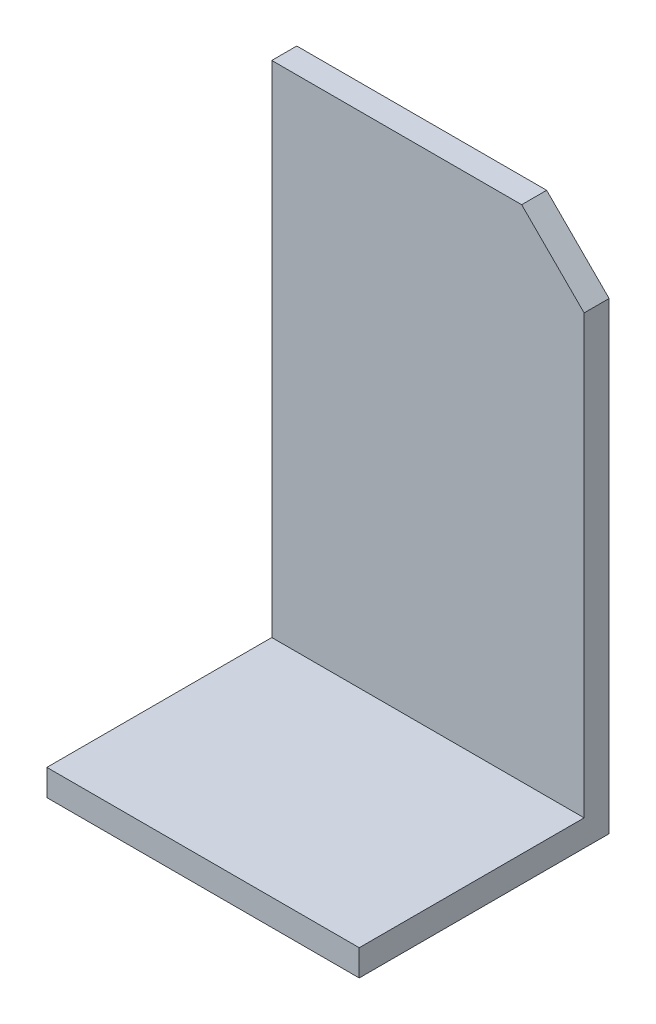
ISO-10303-21;
HEADER;
FILE_DESCRIPTION(('STEP AP214'),'2;1');
FILE_NAME('part.step','',(''),(''),'','','');
FILE_SCHEMA(('AUTOMOTIVE_DESIGN { 1 0 10303 214 1 1 1 1 }'));
ENDSEC;
DATA;
#1=APPLICATION_CONTEXT('core data for automotive mechanical design processes');
#2=APPLICATION_PROTOCOL_DEFINITION('international standard','automotive_design',2000,#1);
#3=PRODUCT_CONTEXT('',#1,'mechanical');
#4=PRODUCT('Part','Part','',(#3));
#5=PRODUCT_RELATED_PRODUCT_CATEGORY('part','',(#4));
#6=PRODUCT_DEFINITION_FORMATION('','',#4);
#7=PRODUCT_DEFINITION_CONTEXT('part definition',#1,'design');
#8=PRODUCT_DEFINITION('design','',#6,#7);
#9=PRODUCT_DEFINITION_SHAPE('','',#8);
#10=(LENGTH_UNIT() NAMED_UNIT(*) SI_UNIT(.MILLI.,.METRE.));
#11=(NAMED_UNIT(*) PLANE_ANGLE_UNIT() SI_UNIT($,.RADIAN.));
#12=(NAMED_UNIT(*) SI_UNIT($,.STERADIAN.) SOLID_ANGLE_UNIT());
#13=UNCERTAINTY_MEASURE_WITH_UNIT(LENGTH_MEASURE(1.E-05),#10,'distance_accuracy_value','');
#14=(GEOMETRIC_REPRESENTATION_CONTEXT(3) GLOBAL_UNCERTAINTY_ASSIGNED_CONTEXT((#13)) GLOBAL_UNIT_ASSIGNED_CONTEXT((#10,
#11,#12)) REPRESENTATION_CONTEXT('',''));
#15=CARTESIAN_POINT('',(0.,0.,0.));
#16=DIRECTION('',(0.,0.,1.));
#17=DIRECTION('',(1.,0.,0.));
#18=AXIS2_PLACEMENT_3D('',#15,#16,#17);
#19=CARTESIAN_POINT('',(0.72167930040457,-1.5105,0.2));
#20=DIRECTION('',(0.,0.,1.));
#21=DIRECTION('',(0.,-1.,0.));
#22=AXIS2_PLACEMENT_3D('',#19,#20,#21);
#23=PLANE('',#22);
#24=DIRECTION('',(0.,-1.,0.));
#25=VECTOR('',#24,1.);
#26=CARTESIAN_POINT('',(0.59667930040457,-1.36847101449275,0.2));
#27=LINE('',#26,#25);
#28=CARTESIAN_POINT('',(0.59667930040457,-1.5,0.2));
#29=VERTEX_POINT('',#28);
#30=CARTESIAN_POINT('',(0.59667930040457,-1.521,0.2));
#31=VERTEX_POINT('',#30);
#32=EDGE_CURVE('E108',#29,#31,#27,.T.);
#33=ORIENTED_EDGE('',*,*,#32,.T.);
#34=DIRECTION('',(1.,0.,0.));
#35=VECTOR('',#34,1.);
#36=CARTESIAN_POINT('',(0.72167930040457,-1.521,0.2));
#37=LINE('',#36,#35);
#38=CARTESIAN_POINT('',(0.84667930040457,-1.521,0.2));
#39=VERTEX_POINT('',#38);
#40=EDGE_CURVE('E112',#31,#39,#37,.T.);
#41=ORIENTED_EDGE('',*,*,#40,.T.);
#42=DIRECTION('',(0.,-1.,0.));
#43=VECTOR('',#42,1.);
#44=CARTESIAN_POINT('',(0.846679300404568,-1.39066637478108,0.2));
#45=LINE('',#44,#43);
#46=CARTESIAN_POINT('',(0.846679300404569,-1.5,0.2));
#47=VERTEX_POINT('',#46);
#48=EDGE_CURVE('E161',#47,#39,#45,.T.);
#49=ORIENTED_EDGE('',*,*,#48,.F.);
#50=DIRECTION('',(1.,0.,0.));
#51=VECTOR('',#50,1.);
#52=CARTESIAN_POINT('',(0.72167930040457,-1.5,0.2));
#53=LINE('',#52,#51);
#54=EDGE_CURVE('E27',#29,#47,#53,.T.);
#55=ORIENTED_EDGE('',*,*,#54,.F.);
#56=EDGE_LOOP('',(#33,#41,#49,#55));
#57=FACE_BOUND('',#56,.T.);
#58=ADVANCED_FACE('F16',(#57),#23,.T.);
#59=CARTESIAN_POINT('',(0.718390642915422,-1.30501737448108,0.02));
#60=DIRECTION('',(0.,0.,1.));
#61=DIRECTION('',(0.,-1.,0.));
#62=AXIS2_PLACEMENT_3D('',#59,#60,#61);
#63=PLANE('',#62);
#64=DIRECTION('',(1.,0.,0.));
#65=VECTOR('',#64,1.);
#66=CARTESIAN_POINT('',(0.696679300404569,-1.1,0.02));
#67=LINE('',#66,#65);
#68=CARTESIAN_POINT('',(0.59667930040457,-1.1,0.02));
#69=VERTEX_POINT('',#68);
#70=CARTESIAN_POINT('',(0.796679300404568,-1.1,0.02));
#71=VERTEX_POINT('',#70);
#72=EDGE_CURVE('E163',#69,#71,#67,.T.);
#73=ORIENTED_EDGE('',*,*,#72,.F.);
#74=DIRECTION('',(0.,-1.,0.));
#75=VECTOR('',#74,1.);
#76=CARTESIAN_POINT('',(0.59667930040457,-1.36847101449275,0.02));
#77=LINE('',#76,#75);
#78=CARTESIAN_POINT('',(0.59667930040457,-1.5,0.02));
#79=VERTEX_POINT('',#78);
#80=EDGE_CURVE('E142',#69,#79,#77,.T.);
#81=ORIENTED_EDGE('',*,*,#80,.T.);
#82=DIRECTION('',(-1.,0.,0.));
#83=VECTOR('',#82,1.);
#84=CARTESIAN_POINT('',(0.72167930040457,-1.5,0.02));
#85=LINE('',#84,#83);
#86=CARTESIAN_POINT('',(0.846679300404569,-1.5,0.02));
#87=VERTEX_POINT('',#86);
#88=EDGE_CURVE('E11',#87,#79,#85,.T.);
#89=ORIENTED_EDGE('',*,*,#88,.F.);
#90=DIRECTION('',(0.,-1.,0.));
#91=VECTOR('',#90,1.);
#92=CARTESIAN_POINT('',(0.846679300404568,-1.39066637478108,0.02));
#93=LINE('',#92,#91);
#94=CARTESIAN_POINT('',(0.846679300404569,-1.15,0.02));
#95=VERTEX_POINT('',#94);
#96=EDGE_CURVE('E140',#95,#87,#93,.T.);
#97=ORIENTED_EDGE('',*,*,#96,.F.);
#98=DIRECTION('',(0.707106781186548,-0.707106781186547,0.));
#99=VECTOR('',#98,1.);
#100=CARTESIAN_POINT('',(0.821679300404569,-1.125,0.02));
#101=LINE('',#100,#99);
#102=EDGE_CURVE('E42',#71,#95,#101,.T.);
#103=ORIENTED_EDGE('',*,*,#102,.F.);
#104=EDGE_LOOP('',(#73,#81,#89,#97,#103));
#105=FACE_BOUND('',#104,.T.);
#106=ADVANCED_FACE('F202',(#105),#63,.T.);
#107=CARTESIAN_POINT('',(0.72167930040457,-1.5,0.11));
#108=DIRECTION('',(0.,1.,0.));
#109=DIRECTION('',(1.,0.,0.));
#110=AXIS2_PLACEMENT_3D('',#107,#108,#109);
#111=PLANE('',#110);
#112=DIRECTION('',(0.,0.,1.));
#113=VECTOR('',#112,1.);
#114=CARTESIAN_POINT('',(0.59667930040457,-1.5,0.0420289855072462));
#115=LINE('',#114,#113);
#116=EDGE_CURVE('E116',#79,#29,#115,.T.);
#117=ORIENTED_EDGE('',*,*,#116,.T.);
#118=ORIENTED_EDGE('',*,*,#54,.T.);
#119=DIRECTION('',(0.,0.,1.));
#120=VECTOR('',#119,1.);
#121=CARTESIAN_POINT('',(0.846679300404569,-1.5,0.0448336252189141));
#122=LINE('',#121,#120);
#123=EDGE_CURVE('E159',#87,#47,#122,.T.);
#124=ORIENTED_EDGE('',*,*,#123,.F.);
#125=ORIENTED_EDGE('',*,*,#88,.T.);
#126=EDGE_LOOP('',(#117,#118,#124,#125));
#127=FACE_BOUND('',#126,.T.);
#128=ADVANCED_FACE('F193',(#127),#111,.T.);
#129=CARTESIAN_POINT('',(0.821679300404569,-1.125,0.01));
#130=DIRECTION('',(0.707106781186547,0.707106781186548,0.));
#131=DIRECTION('',(0.,0.,-1.));
#132=AXIS2_PLACEMENT_3D('',#129,#130,#131);
#133=PLANE('',#132);
#134=DIRECTION('',(0.,0.,1.));
#135=VECTOR('',#134,1.);
#136=CARTESIAN_POINT('',(0.846679300404567,-1.15,0.0448336252189141));
#137=LINE('',#136,#135);
#138=CARTESIAN_POINT('',(0.846679300404569,-1.15,0.));
#139=VERTEX_POINT('',#138);
#140=EDGE_CURVE('E128',#139,#95,#137,.T.);
#141=ORIENTED_EDGE('',*,*,#140,.F.);
#142=DIRECTION('',(-0.707106781186541,0.707106781186554,0.));
#143=VECTOR('',#142,1.);
#144=CARTESIAN_POINT('',(0.846679300404568,-1.15,0.));
#145=LINE('',#144,#143);
#146=CARTESIAN_POINT('',(0.796679300404568,-1.1,0.));
#147=VERTEX_POINT('',#146);
#148=EDGE_CURVE('E141',#139,#147,#145,.T.);
#149=ORIENTED_EDGE('',*,*,#148,.T.);
#150=DIRECTION('',(0.,0.,-1.));
#151=VECTOR('',#150,1.);
#152=CARTESIAN_POINT('',(0.796679300404568,-1.1,0.01));
#153=LINE('',#152,#151);
#154=EDGE_CURVE('E20',#71,#147,#153,.T.);
#155=ORIENTED_EDGE('',*,*,#154,.F.);
#156=ORIENTED_EDGE('',*,*,#102,.T.);
#157=EDGE_LOOP('',(#141,#149,#155,#156));
#158=FACE_BOUND('',#157,.T.);
#159=ADVANCED_FACE('F200',(#158),#133,.T.);
#160=CARTESIAN_POINT('',(0.696679300404569,-1.1,0.01));
#161=DIRECTION('',(0.,1.,0.));
#162=DIRECTION('',(1.,0.,0.));
#163=AXIS2_PLACEMENT_3D('',#160,#161,#162);
#164=PLANE('',#163);
#165=ORIENTED_EDGE('',*,*,#154,.T.);
#166=DIRECTION('',(-1.,0.,0.));
#167=VECTOR('',#166,1.);
#168=CARTESIAN_POINT('',(0.718495863065486,-1.1,0.));
#169=LINE('',#168,#167);
#170=CARTESIAN_POINT('',(0.59667930040457,-1.1,0.));
#171=VERTEX_POINT('',#170);
#172=EDGE_CURVE('E171',#147,#171,#169,.T.);
#173=ORIENTED_EDGE('',*,*,#172,.T.);
#174=DIRECTION('',(0.,0.,1.));
#175=VECTOR('',#174,1.);
#176=CARTESIAN_POINT('',(0.59667930040457,-1.1,0.0420289855072462));
#177=LINE('',#176,#175);
#178=EDGE_CURVE('E75',#171,#69,#177,.T.);
#179=ORIENTED_EDGE('',*,*,#178,.T.);
#180=ORIENTED_EDGE('',*,*,#72,.T.);
#181=EDGE_LOOP('',(#165,#173,#179,#180));
#182=FACE_BOUND('',#181,.T.);
#183=ADVANCED_FACE('F214',(#182),#164,.T.);
#184=CARTESIAN_POINT('',(0.59667930040457,-1.36847101449275,0.0420289855072462));
#185=DIRECTION('',(1.,0.,0.));
#186=DIRECTION('',(0.,-1.,0.));
#187=AXIS2_PLACEMENT_3D('',#184,#185,#186);
#188=PLANE('',#187);
#189=DIRECTION('',(0.,0.,1.));
#190=VECTOR('',#189,1.);
#191=CARTESIAN_POINT('',(0.59667930040457,-1.521,0.1));
#192=LINE('',#191,#190);
#193=CARTESIAN_POINT('',(0.59667930040457,-1.521,0.));
#194=VERTEX_POINT('',#193);
#195=EDGE_CURVE('E117',#194,#31,#192,.T.);
#196=ORIENTED_EDGE('',*,*,#195,.T.);
#197=ORIENTED_EDGE('',*,*,#32,.F.);
#198=ORIENTED_EDGE('',*,*,#116,.F.);
#199=ORIENTED_EDGE('',*,*,#80,.F.);
#200=ORIENTED_EDGE('',*,*,#178,.F.);
#201=DIRECTION('',(0.,-1.,0.));
#202=VECTOR('',#201,1.);
#203=CARTESIAN_POINT('',(0.59667930040457,-1.31559112123515,0.));
#204=LINE('',#203,#202);
#205=EDGE_CURVE('E120',#171,#194,#204,.T.);
#206=ORIENTED_EDGE('',*,*,#205,.T.);
#207=EDGE_LOOP('',(#196,#197,#198,#199,#200,#206));
#208=FACE_BOUND('',#207,.T.);
#209=ADVANCED_FACE('F18',(#208),#188,.F.);
#210=CARTESIAN_POINT('',(0.72167930040457,-1.521,0.1));
#211=DIRECTION('',(0.,1.,0.));
#212=DIRECTION('',(1.,0.,0.));
#213=AXIS2_PLACEMENT_3D('',#210,#211,#212);
#214=PLANE('',#213);
#215=DIRECTION('',(1.,0.,0.));
#216=VECTOR('',#215,1.);
#217=CARTESIAN_POINT('',(0.718495863065486,-1.521,0.));
#218=LINE('',#217,#216);
#219=CARTESIAN_POINT('',(0.84667930040457,-1.521,0.));
#220=VERTEX_POINT('',#219);
#221=EDGE_CURVE('E172',#194,#220,#218,.T.);
#222=ORIENTED_EDGE('',*,*,#221,.T.);
#223=DIRECTION('',(0.,0.,-1.));
#224=VECTOR('',#223,1.);
#225=CARTESIAN_POINT('',(0.846679300404569,-1.521,0.0448336252189141));
#226=LINE('',#225,#224);
#227=EDGE_CURVE('E89',#39,#220,#226,.T.);
#228=ORIENTED_EDGE('',*,*,#227,.F.);
#229=ORIENTED_EDGE('',*,*,#40,.F.);
#230=ORIENTED_EDGE('',*,*,#195,.F.);
#231=EDGE_LOOP('',(#222,#228,#229,#230));
#232=FACE_BOUND('',#231,.T.);
#233=ADVANCED_FACE('F126',(#232),#214,.F.);
#234=CARTESIAN_POINT('',(0.846679300404568,-1.39066637478108,0.0448336252189141));
#235=DIRECTION('',(1.,0.,0.));
#236=DIRECTION('',(0.,1.,0.));
#237=AXIS2_PLACEMENT_3D('',#234,#235,#236);
#238=PLANE('',#237);
#239=ORIENTED_EDGE('',*,*,#96,.T.);
#240=ORIENTED_EDGE('',*,*,#123,.T.);
#241=ORIENTED_EDGE('',*,*,#48,.T.);
#242=ORIENTED_EDGE('',*,*,#227,.T.);
#243=DIRECTION('',(0.,1.,0.));
#244=VECTOR('',#243,1.);
#245=CARTESIAN_POINT('',(0.84667930040457,-1.31559112123515,0.));
#246=LINE('',#245,#244);
#247=EDGE_CURVE('E139',#220,#139,#246,.T.);
#248=ORIENTED_EDGE('',*,*,#247,.T.);
#249=ORIENTED_EDGE('',*,*,#140,.T.);
#250=EDGE_LOOP('',(#239,#240,#241,#242,#248,#249));
#251=FACE_BOUND('',#250,.T.);
#252=ADVANCED_FACE('F191',(#251),#238,.T.);
#253=CARTESIAN_POINT('',(0.718495863065486,-1.31559112123515,0.));
#254=DIRECTION('',(0.,0.,1.));
#255=DIRECTION('',(0.,-1.,0.));
#256=AXIS2_PLACEMENT_3D('',#253,#254,#255);
#257=PLANE('',#256);
#258=ORIENTED_EDGE('',*,*,#221,.F.);
#259=ORIENTED_EDGE('',*,*,#205,.F.);
#260=ORIENTED_EDGE('',*,*,#172,.F.);
#261=ORIENTED_EDGE('',*,*,#148,.F.);
#262=ORIENTED_EDGE('',*,*,#247,.F.);
#263=EDGE_LOOP('',(#258,#259,#260,#261,#262));
#264=FACE_BOUND('',#263,.T.);
#265=ADVANCED_FACE('F218',(#264),#257,.F.);
#266=CLOSED_SHELL('',(#58,#106,#128,#159,#183,#209,#233,#252,#265));
#267=MANIFOLD_SOLID_BREP('B1',#266);
#268=ADVANCED_BREP_SHAPE_REPRESENTATION('',(#18,#267),#14);
#269=SHAPE_DEFINITION_REPRESENTATION(#9,#268);
ENDSEC;
END-ISO-10303-21;
